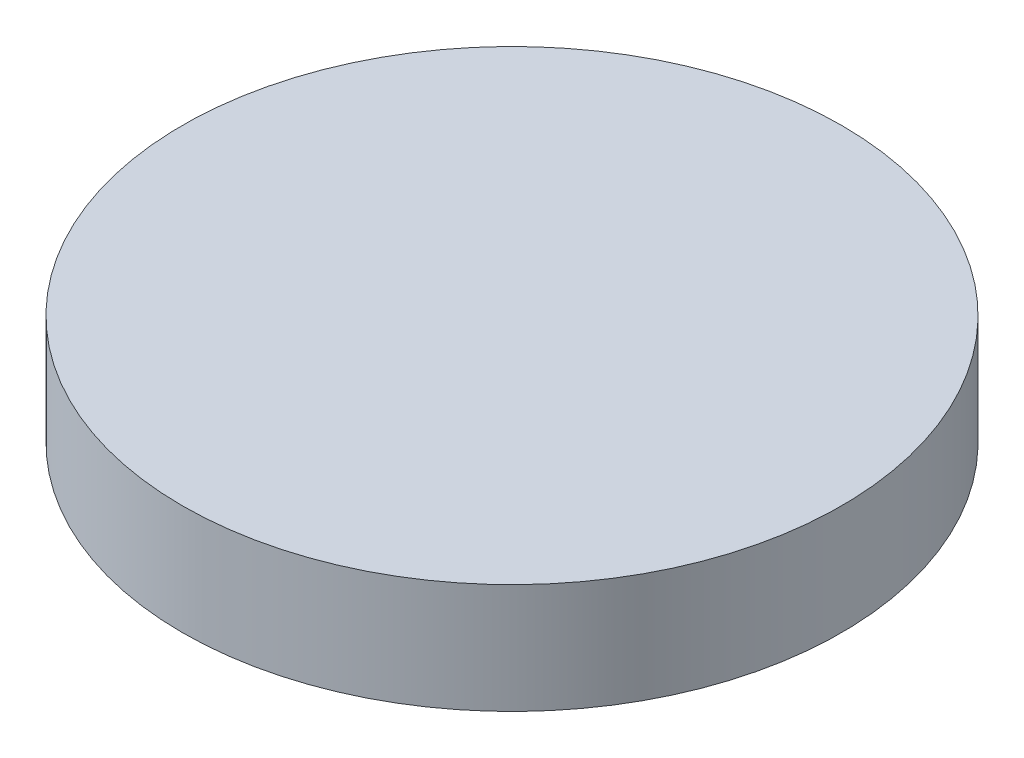
ISO-10303-21;
HEADER;
FILE_DESCRIPTION(('STEP AP214'),'2;1');
FILE_NAME('part.step','',(''),(''),'','','');
FILE_SCHEMA(('AUTOMOTIVE_DESIGN { 1 0 10303 214 1 1 1 1 }'));
ENDSEC;
DATA;
#1=APPLICATION_CONTEXT('core data for automotive mechanical design processes');
#2=APPLICATION_PROTOCOL_DEFINITION('international standard','automotive_design',2000,#1);
#3=PRODUCT_CONTEXT('',#1,'mechanical');
#4=PRODUCT('Part','Part','',(#3));
#5=PRODUCT_RELATED_PRODUCT_CATEGORY('part','',(#4));
#6=PRODUCT_DEFINITION_FORMATION('','',#4);
#7=PRODUCT_DEFINITION_CONTEXT('part definition',#1,'design');
#8=PRODUCT_DEFINITION('design','',#6,#7);
#9=PRODUCT_DEFINITION_SHAPE('','',#8);
#10=(LENGTH_UNIT() NAMED_UNIT(*) SI_UNIT(.MILLI.,.METRE.));
#11=(NAMED_UNIT(*) PLANE_ANGLE_UNIT() SI_UNIT($,.RADIAN.));
#12=(NAMED_UNIT(*) SI_UNIT($,.STERADIAN.) SOLID_ANGLE_UNIT());
#13=UNCERTAINTY_MEASURE_WITH_UNIT(LENGTH_MEASURE(1.E-05),#10,'distance_accuracy_value','');
#14=(GEOMETRIC_REPRESENTATION_CONTEXT(3) GLOBAL_UNCERTAINTY_ASSIGNED_CONTEXT((#13)) GLOBAL_UNIT_ASSIGNED_CONTEXT((#10,
#11,#12)) REPRESENTATION_CONTEXT('',''));
#15=CARTESIAN_POINT('',(0.,0.,0.));
#16=DIRECTION('',(0.,0.,1.));
#17=DIRECTION('',(1.,0.,0.));
#18=AXIS2_PLACEMENT_3D('',#15,#16,#17);
#19=CARTESIAN_POINT('',(0.,10.,0.));
#20=DIRECTION('',(0.,-1.,0.));
#21=DIRECTION('',(0.,0.,-1.));
#22=AXIS2_PLACEMENT_3D('',#19,#20,#21);
#23=CYLINDRICAL_SURFACE('',#22,30.);
#24=CARTESIAN_POINT('',(0.,10.,0.));
#25=DIRECTION('',(0.,1.,0.));
#26=DIRECTION('',(0.,0.,1.));
#27=AXIS2_PLACEMENT_3D('',#24,#25,#26);
#28=CIRCLE('',#27,30.);
#29=CARTESIAN_POINT('',(0.,10.,30.));
#30=VERTEX_POINT('',#29);
#31=EDGE_CURVE('E10',#30,#30,#28,.T.);
#32=ORIENTED_EDGE('',*,*,#31,.F.);
#33=EDGE_LOOP('',(#32));
#34=FACE_BOUND('',#33,.T.);
#35=CARTESIAN_POINT('',(0.,0.,0.));
#36=DIRECTION('',(0.,1.,0.));
#37=DIRECTION('',(0.,0.,1.));
#38=AXIS2_PLACEMENT_3D('',#35,#36,#37);
#39=CIRCLE('',#38,30.);
#40=CARTESIAN_POINT('',(0.,0.,30.));
#41=VERTEX_POINT('',#40);
#42=EDGE_CURVE('E40',#41,#41,#39,.T.);
#43=ORIENTED_EDGE('',*,*,#42,.T.);
#44=EDGE_LOOP('',(#43));
#45=FACE_BOUND('',#44,.T.);
#46=ADVANCED_FACE('F37',(#34,#45),#23,.T.);
#47=CARTESIAN_POINT('',(0.,10.,0.));
#48=DIRECTION('',(0.,1.,0.));
#49=DIRECTION('',(0.,0.,1.));
#50=AXIS2_PLACEMENT_3D('',#47,#48,#49);
#51=PLANE('',#50);
#52=ORIENTED_EDGE('',*,*,#31,.T.);
#53=EDGE_LOOP('',(#52));
#54=FACE_BOUND('',#53,.T.);
#55=ADVANCED_FACE('F54',(#54),#51,.T.);
#56=CARTESIAN_POINT('',(0.,0.,0.));
#57=DIRECTION('',(0.,1.,0.));
#58=DIRECTION('',(0.,0.,1.));
#59=AXIS2_PLACEMENT_3D('',#56,#57,#58);
#60=PLANE('',#59);
#61=ORIENTED_EDGE('',*,*,#42,.F.);
#62=EDGE_LOOP('',(#61));
#63=FACE_BOUND('',#62,.T.);
#64=ADVANCED_FACE('F52',(#63),#60,.F.);
#65=CLOSED_SHELL('',(#46,#55,#64));
#66=MANIFOLD_SOLID_BREP('B2',#65);
#67=ADVANCED_BREP_SHAPE_REPRESENTATION('',(#18,#66),#14);
#68=SHAPE_DEFINITION_REPRESENTATION(#9,#67);
ENDSEC;
END-ISO-10303-21;
